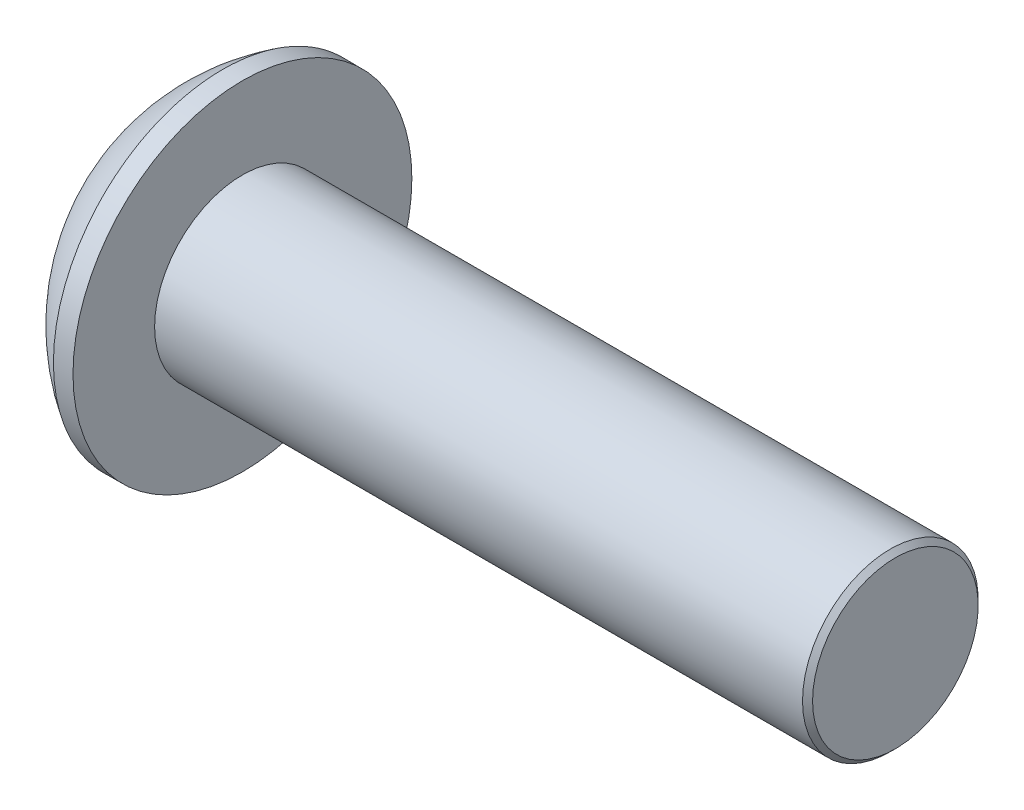
ISO-10303-21;
HEADER;
FILE_DESCRIPTION(('STEP AP214'),'2;1');
FILE_NAME('part.step','',(''),(''),'','','');
FILE_SCHEMA(('AUTOMOTIVE_DESIGN { 1 0 10303 214 1 1 1 1 }'));
ENDSEC;
DATA;
#1=APPLICATION_CONTEXT('core data for automotive mechanical design processes');
#2=APPLICATION_PROTOCOL_DEFINITION('international standard','automotive_design',2000,#1);
#3=PRODUCT_CONTEXT('',#1,'mechanical');
#4=PRODUCT('Part','Part','',(#3));
#5=PRODUCT_RELATED_PRODUCT_CATEGORY('part','',(#4));
#6=PRODUCT_DEFINITION_FORMATION('','',#4);
#7=PRODUCT_DEFINITION_CONTEXT('part definition',#1,'design');
#8=PRODUCT_DEFINITION('design','',#6,#7);
#9=PRODUCT_DEFINITION_SHAPE('','',#8);
#10=(LENGTH_UNIT() NAMED_UNIT(*) SI_UNIT(.MILLI.,.METRE.));
#11=(NAMED_UNIT(*) PLANE_ANGLE_UNIT() SI_UNIT($,.RADIAN.));
#12=(NAMED_UNIT(*) SI_UNIT($,.STERADIAN.) SOLID_ANGLE_UNIT());
#13=UNCERTAINTY_MEASURE_WITH_UNIT(LENGTH_MEASURE(1.E-05),#10,'distance_accuracy_value','');
#14=(GEOMETRIC_REPRESENTATION_CONTEXT(3) GLOBAL_UNCERTAINTY_ASSIGNED_CONTEXT((#13)) GLOBAL_UNIT_ASSIGNED_CONTEXT((#10,
#11,#12)) REPRESENTATION_CONTEXT('',''));
#15=CARTESIAN_POINT('',(0.,0.,0.));
#16=DIRECTION('',(0.,0.,1.));
#17=DIRECTION('',(1.,0.,0.));
#18=AXIS2_PLACEMENT_3D('',#15,#16,#17);
#19=CARTESIAN_POINT('',(1.32080000000034,0.,0.));
#20=DIRECTION('',(-1.,0.,0.));
#21=DIRECTION('',(0.,0.,1.));
#22=AXIS2_PLACEMENT_3D('',#19,#20,#21);
#23=CONICAL_SURFACE('',#22,1.1937999999998,1.04719755119608);
#24=CARTESIAN_POINT('',(2.01004075135902,0.,4.44089209850063E-13));
#25=VERTEX_POINT('',#24);
#26=VERTEX_LOOP('',#25);
#27=FACE_BOUND('',#26,.T.);
#28=CARTESIAN_POINT('',(1.32080000000009,0.,0.));
#29=DIRECTION('',(-1.,0.,0.));
#30=DIRECTION('',(0.,0.,1.));
#31=AXIS2_PLACEMENT_3D('',#28,#29,#30);
#32=CIRCLE('',#31,1.19380000000024);
#33=CARTESIAN_POINT('',(1.32080000000004,-1.03386112703797,0.59690000000006));
#34=VERTEX_POINT('',#33);
#35=CARTESIAN_POINT('',(1.32080000000004,0.,1.19380000000012));
#36=VERTEX_POINT('',#35);
#37=EDGE_CURVE('E18',#34,#36,#32,.T.);
#38=ORIENTED_EDGE('',*,*,#37,.T.);
#39=CARTESIAN_POINT('',(1.32080000000009,0.,0.));
#40=DIRECTION('',(-1.,0.,0.));
#41=DIRECTION('',(0.,0.,1.));
#42=AXIS2_PLACEMENT_3D('',#39,#40,#41);
#43=CIRCLE('',#42,1.19380000000024);
#44=CARTESIAN_POINT('',(1.32080000000004,1.03386112703797,0.596900000000061));
#45=VERTEX_POINT('',#44);
#46=EDGE_CURVE('E139',#36,#45,#43,.T.);
#47=ORIENTED_EDGE('',*,*,#46,.T.);
#48=CARTESIAN_POINT('',(1.32080000000009,0.,0.));
#49=DIRECTION('',(-1.,0.,0.));
#50=DIRECTION('',(0.,0.,1.));
#51=AXIS2_PLACEMENT_3D('',#48,#49,#50);
#52=CIRCLE('',#51,1.19380000000024);
#53=CARTESIAN_POINT('',(1.32080000000004,1.03386112703797,-0.596900000000061));
#54=VERTEX_POINT('',#53);
#55=EDGE_CURVE('E268',#45,#54,#52,.T.);
#56=ORIENTED_EDGE('',*,*,#55,.T.);
#57=CARTESIAN_POINT('',(1.32080000000009,0.,0.));
#58=DIRECTION('',(-1.,0.,0.));
#59=DIRECTION('',(0.,0.,1.));
#60=AXIS2_PLACEMENT_3D('',#57,#58,#59);
#61=CIRCLE('',#60,1.19380000000024);
#62=CARTESIAN_POINT('',(1.32080000000004,1.49457637585666E-12,-1.19380000000012));
#63=VERTEX_POINT('',#62);
#64=EDGE_CURVE('E266',#54,#63,#61,.T.);
#65=ORIENTED_EDGE('',*,*,#64,.T.);
#66=CARTESIAN_POINT('',(1.32080000000009,0.,0.));
#67=DIRECTION('',(-1.,0.,0.));
#68=DIRECTION('',(0.,0.,1.));
#69=AXIS2_PLACEMENT_3D('',#66,#67,#68);
#70=CIRCLE('',#69,1.19380000000024);
#71=CARTESIAN_POINT('',(1.32080000000004,-1.03386112703797,-0.59690000000006));
#72=VERTEX_POINT('',#71);
#73=EDGE_CURVE('E91',#63,#72,#70,.T.);
#74=ORIENTED_EDGE('',*,*,#73,.T.);
#75=CARTESIAN_POINT('',(1.32080000000009,0.,0.));
#76=DIRECTION('',(-1.,0.,0.));
#77=DIRECTION('',(0.,0.,1.));
#78=AXIS2_PLACEMENT_3D('',#75,#76,#77);
#79=CIRCLE('',#78,1.19380000000024);
#80=EDGE_CURVE('E87',#72,#34,#79,.T.);
#81=ORIENTED_EDGE('',*,*,#80,.T.);
#82=EDGE_LOOP('',(#38,#47,#56,#65,#74,#81));
#83=FACE_BOUND('',#82,.T.);
#84=ADVANCED_FACE('F14',(#27,#83),#23,.F.);
#85=CARTESIAN_POINT('',(1.3208,-2.06772225407572,-1.1938));
#86=DIRECTION('',(1.,0.,0.));
#87=DIRECTION('',(0.,0.,-1.));
#88=AXIS2_PLACEMENT_3D('',#85,#86,#87);
#89=PLANE('',#88);
#90=DIRECTION('',(0.,0.5,0.866025403784439));
#91=VECTOR('',#90,1.);
#92=CARTESIAN_POINT('',(1.3208,-1.37848150271715,0.));
#93=LINE('',#92,#91);
#94=CARTESIAN_POINT('',(1.3208,-0.689240751358574,1.1938));
#95=VERTEX_POINT('',#94);
#96=EDGE_CURVE('E99',#95,#34,#93,.F.);
#97=ORIENTED_EDGE('',*,*,#96,.F.);
#98=DIRECTION('',(0.,1.,0.));
#99=VECTOR('',#98,1.);
#100=CARTESIAN_POINT('',(1.3208,-0.689240751358574,1.1938));
#101=LINE('',#100,#99);
#102=EDGE_CURVE('E101',#36,#95,#101,.F.);
#103=ORIENTED_EDGE('',*,*,#102,.F.);
#104=ORIENTED_EDGE('',*,*,#37,.F.);
#105=EDGE_LOOP('',(#97,#103,#104));
#106=FACE_BOUND('',#105,.T.);
#107=ADVANCED_FACE('F97',(#106),#89,.F.);
#108=CARTESIAN_POINT('',(1.3208,-2.06772225407572,-1.1938));
#109=DIRECTION('',(1.,0.,0.));
#110=DIRECTION('',(0.,0.,-1.));
#111=AXIS2_PLACEMENT_3D('',#108,#109,#110);
#112=PLANE('',#111);
#113=DIRECTION('',(0.,-0.5,0.866025403784439));
#114=VECTOR('',#113,1.);
#115=CARTESIAN_POINT('',(1.3208,-0.689240751358574,-1.1938));
#116=LINE('',#115,#114);
#117=CARTESIAN_POINT('',(1.3208,-1.37848150271715,0.));
#118=VERTEX_POINT('',#117);
#119=EDGE_CURVE('E107',#118,#72,#116,.F.);
#120=ORIENTED_EDGE('',*,*,#119,.F.);
#121=DIRECTION('',(0.,0.5,0.866025403784439));
#122=VECTOR('',#121,1.);
#123=CARTESIAN_POINT('',(1.3208,-1.37848150271715,0.));
#124=LINE('',#123,#122);
#125=EDGE_CURVE('E104',#34,#118,#124,.F.);
#126=ORIENTED_EDGE('',*,*,#125,.F.);
#127=ORIENTED_EDGE('',*,*,#80,.F.);
#128=EDGE_LOOP('',(#120,#126,#127));
#129=FACE_BOUND('',#128,.T.);
#130=ADVANCED_FACE('F105',(#129),#112,.F.);
#131=CARTESIAN_POINT('',(1.3208,-2.06772225407572,-1.1938));
#132=DIRECTION('',(1.,0.,0.));
#133=DIRECTION('',(0.,0.,-1.));
#134=AXIS2_PLACEMENT_3D('',#131,#132,#133);
#135=PLANE('',#134);
#136=DIRECTION('',(0.,1.,0.));
#137=VECTOR('',#136,1.);
#138=CARTESIAN_POINT('',(1.3208,0.689240751358577,-1.1938));
#139=LINE('',#138,#137);
#140=CARTESIAN_POINT('',(1.3208,-0.689240751358574,-1.1938));
#141=VERTEX_POINT('',#140);
#142=EDGE_CURVE('E235',#141,#63,#139,.T.);
#143=ORIENTED_EDGE('',*,*,#142,.F.);
#144=DIRECTION('',(0.,-0.5,0.866025403784439));
#145=VECTOR('',#144,1.);
#146=CARTESIAN_POINT('',(1.3208,-0.689240751358574,-1.1938));
#147=LINE('',#146,#145);
#148=EDGE_CURVE('E240',#72,#141,#147,.F.);
#149=ORIENTED_EDGE('',*,*,#148,.F.);
#150=ORIENTED_EDGE('',*,*,#73,.F.);
#151=EDGE_LOOP('',(#143,#149,#150));
#152=FACE_BOUND('',#151,.T.);
#153=ADVANCED_FACE('F182',(#152),#135,.F.);
#154=CARTESIAN_POINT('',(1.3208,-2.06772225407572,-1.1938));
#155=DIRECTION('',(1.,0.,0.));
#156=DIRECTION('',(0.,0.,-1.));
#157=AXIS2_PLACEMENT_3D('',#154,#155,#156);
#158=PLANE('',#157);
#159=DIRECTION('',(0.,-0.5,-0.866025403784439));
#160=VECTOR('',#159,1.);
#161=CARTESIAN_POINT('',(1.3208,1.37848150271715,0.));
#162=LINE('',#161,#160);
#163=CARTESIAN_POINT('',(1.3208,0.689240751358577,-1.1938));
#164=VERTEX_POINT('',#163);
#165=EDGE_CURVE('E226',#164,#54,#162,.F.);
#166=ORIENTED_EDGE('',*,*,#165,.F.);
#167=DIRECTION('',(0.,1.,0.));
#168=VECTOR('',#167,1.);
#169=CARTESIAN_POINT('',(1.3208,0.689240751358577,-1.1938));
#170=LINE('',#169,#168);
#171=EDGE_CURVE('E232',#63,#164,#170,.T.);
#172=ORIENTED_EDGE('',*,*,#171,.F.);
#173=ORIENTED_EDGE('',*,*,#64,.F.);
#174=EDGE_LOOP('',(#166,#172,#173));
#175=FACE_BOUND('',#174,.T.);
#176=ADVANCED_FACE('F178',(#175),#158,.F.);
#177=CARTESIAN_POINT('',(1.3208,-2.06772225407572,-1.1938));
#178=DIRECTION('',(1.,0.,0.));
#179=DIRECTION('',(0.,0.,-1.));
#180=AXIS2_PLACEMENT_3D('',#177,#178,#179);
#181=PLANE('',#180);
#182=DIRECTION('',(0.,0.5,-0.866025403784439));
#183=VECTOR('',#182,1.);
#184=CARTESIAN_POINT('',(1.3208,0.689240751358576,1.1938));
#185=LINE('',#184,#183);
#186=CARTESIAN_POINT('',(1.3208,1.37848150271715,0.));
#187=VERTEX_POINT('',#186);
#188=EDGE_CURVE('E213',#187,#45,#185,.F.);
#189=ORIENTED_EDGE('',*,*,#188,.F.);
#190=DIRECTION('',(0.,-0.5,-0.866025403784439));
#191=VECTOR('',#190,1.);
#192=CARTESIAN_POINT('',(1.3208,1.37848150271715,0.));
#193=LINE('',#192,#191);
#194=EDGE_CURVE('E224',#54,#187,#193,.F.);
#195=ORIENTED_EDGE('',*,*,#194,.F.);
#196=ORIENTED_EDGE('',*,*,#55,.F.);
#197=EDGE_LOOP('',(#189,#195,#196));
#198=FACE_BOUND('',#197,.T.);
#199=ADVANCED_FACE('F174',(#198),#181,.F.);
#200=CARTESIAN_POINT('',(1.3208,-2.06772225407572,-1.1938));
#201=DIRECTION('',(1.,0.,0.));
#202=DIRECTION('',(0.,0.,-1.));
#203=AXIS2_PLACEMENT_3D('',#200,#201,#202);
#204=PLANE('',#203);
#205=DIRECTION('',(0.,1.,0.));
#206=VECTOR('',#205,1.);
#207=CARTESIAN_POINT('',(1.3208,-0.689240751358574,1.1938));
#208=LINE('',#207,#206);
#209=CARTESIAN_POINT('',(1.3208,0.689240751358576,1.1938));
#210=VERTEX_POINT('',#209);
#211=EDGE_CURVE('E116',#210,#36,#208,.F.);
#212=ORIENTED_EDGE('',*,*,#211,.F.);
#213=DIRECTION('',(0.,0.5,-0.866025403784439));
#214=VECTOR('',#213,1.);
#215=CARTESIAN_POINT('',(1.3208,0.689240751358576,1.1938));
#216=LINE('',#215,#214);
#217=EDGE_CURVE('E216',#45,#210,#216,.F.);
#218=ORIENTED_EDGE('',*,*,#217,.F.);
#219=ORIENTED_EDGE('',*,*,#46,.F.);
#220=EDGE_LOOP('',(#212,#218,#219));
#221=FACE_BOUND('',#220,.T.);
#222=ADVANCED_FACE('F170',(#221),#204,.F.);
#223=CARTESIAN_POINT('',(1.3208,-0.689240751358574,1.1938));
#224=DIRECTION('',(0.,0.,-1.));
#225=DIRECTION('',(0.,1.,0.));
#226=AXIS2_PLACEMENT_3D('',#223,#224,#225);
#227=PLANE('',#226);
#228=DIRECTION('',(0.,1.,0.));
#229=VECTOR('',#228,1.);
#230=CARTESIAN_POINT('',(0.,0.,1.1938));
#231=LINE('',#230,#229);
#232=CARTESIAN_POINT('',(0.,0.689240751358577,1.1938));
#233=VERTEX_POINT('',#232);
#234=CARTESIAN_POINT('',(0.,-0.689240751358574,1.1938));
#235=VERTEX_POINT('',#234);
#236=EDGE_CURVE('E228',#233,#235,#231,.F.);
#237=ORIENTED_EDGE('',*,*,#236,.F.);
#238=DIRECTION('',(1.,0.,0.));
#239=VECTOR('',#238,1.);
#240=CARTESIAN_POINT('',(1.3208,0.689240751358576,1.1938));
#241=LINE('',#240,#239);
#242=EDGE_CURVE('E220',#210,#233,#241,.F.);
#243=ORIENTED_EDGE('',*,*,#242,.F.);
#244=ORIENTED_EDGE('',*,*,#211,.T.);
#245=ORIENTED_EDGE('',*,*,#102,.T.);
#246=DIRECTION('',(1.,0.,0.));
#247=VECTOR('',#246,1.);
#248=CARTESIAN_POINT('',(1.3208,-0.689240751358574,1.1938));
#249=LINE('',#248,#247);
#250=EDGE_CURVE('E110',#235,#95,#249,.T.);
#251=ORIENTED_EDGE('',*,*,#250,.F.);
#252=EDGE_LOOP('',(#237,#243,#244,#245,#251));
#253=FACE_BOUND('',#252,.T.);
#254=ADVANCED_FACE('F167',(#253),#227,.T.);
#255=CARTESIAN_POINT('',(1.3208,-1.37848150271715,0.));
#256=DIRECTION('',(0.,0.866025403784439,-0.5));
#257=DIRECTION('',(0.,0.5,0.866025403784439));
#258=AXIS2_PLACEMENT_3D('',#255,#256,#257);
#259=PLANE('',#258);
#260=DIRECTION('',(0.,-0.5,-0.866025403784439));
#261=VECTOR('',#260,1.);
#262=CARTESIAN_POINT('',(0.,-0.689240751358574,1.1938));
#263=LINE('',#262,#261);
#264=CARTESIAN_POINT('',(0.,-1.37848150271715,0.));
#265=VERTEX_POINT('',#264);
#266=EDGE_CURVE('E249',#235,#265,#263,.T.);
#267=ORIENTED_EDGE('',*,*,#266,.F.);
#268=ORIENTED_EDGE('',*,*,#250,.T.);
#269=ORIENTED_EDGE('',*,*,#96,.T.);
#270=ORIENTED_EDGE('',*,*,#125,.T.);
#271=DIRECTION('',(1.,0.,0.));
#272=VECTOR('',#271,1.);
#273=CARTESIAN_POINT('',(1.3208,-1.37848150271715,0.));
#274=LINE('',#273,#272);
#275=EDGE_CURVE('E119',#265,#118,#274,.T.);
#276=ORIENTED_EDGE('',*,*,#275,.F.);
#277=EDGE_LOOP('',(#267,#268,#269,#270,#276));
#278=FACE_BOUND('',#277,.T.);
#279=ADVANCED_FACE('F114',(#278),#259,.T.);
#280=CARTESIAN_POINT('',(1.3208,-0.689240751358574,-1.1938));
#281=DIRECTION('',(0.,0.866025403784439,0.5));
#282=DIRECTION('',(0.,-0.5,0.866025403784439));
#283=AXIS2_PLACEMENT_3D('',#280,#281,#282);
#284=PLANE('',#283);
#285=DIRECTION('',(0.,0.5,-0.866025403784439));
#286=VECTOR('',#285,1.);
#287=CARTESIAN_POINT('',(0.,-1.37848150271715,0.));
#288=LINE('',#287,#286);
#289=CARTESIAN_POINT('',(0.,-0.689240751358574,-1.1938));
#290=VERTEX_POINT('',#289);
#291=EDGE_CURVE('E247',#265,#290,#288,.T.);
#292=ORIENTED_EDGE('',*,*,#291,.F.);
#293=ORIENTED_EDGE('',*,*,#275,.T.);
#294=ORIENTED_EDGE('',*,*,#119,.T.);
#295=ORIENTED_EDGE('',*,*,#148,.T.);
#296=DIRECTION('',(1.,0.,0.));
#297=VECTOR('',#296,1.);
#298=CARTESIAN_POINT('',(1.3208,-0.689240751358574,-1.1938));
#299=LINE('',#298,#297);
#300=EDGE_CURVE('E231',#290,#141,#299,.T.);
#301=ORIENTED_EDGE('',*,*,#300,.F.);
#302=EDGE_LOOP('',(#292,#293,#294,#295,#301));
#303=FACE_BOUND('',#302,.T.);
#304=ADVANCED_FACE('F160',(#303),#284,.T.);
#305=CARTESIAN_POINT('',(1.3208,0.689240751358577,-1.1938));
#306=DIRECTION('',(0.,0.,1.));
#307=DIRECTION('',(1.,0.,0.));
#308=AXIS2_PLACEMENT_3D('',#305,#306,#307);
#309=PLANE('',#308);
#310=DIRECTION('',(0.,1.,0.));
#311=VECTOR('',#310,1.);
#312=CARTESIAN_POINT('',(0.,0.,-1.1938));
#313=LINE('',#312,#311);
#314=CARTESIAN_POINT('',(0.,0.689240751358577,-1.1938));
#315=VERTEX_POINT('',#314);
#316=EDGE_CURVE('E258',#290,#315,#313,.T.);
#317=ORIENTED_EDGE('',*,*,#316,.F.);
#318=ORIENTED_EDGE('',*,*,#300,.T.);
#319=ORIENTED_EDGE('',*,*,#142,.T.);
#320=ORIENTED_EDGE('',*,*,#171,.T.);
#321=DIRECTION('',(1.,0.,0.));
#322=VECTOR('',#321,1.);
#323=CARTESIAN_POINT('',(1.3208,0.689240751358577,-1.1938));
#324=LINE('',#323,#322);
#325=EDGE_CURVE('E217',#315,#164,#324,.T.);
#326=ORIENTED_EDGE('',*,*,#325,.F.);
#327=EDGE_LOOP('',(#317,#318,#319,#320,#326));
#328=FACE_BOUND('',#327,.T.);
#329=ADVANCED_FACE('F157',(#328),#309,.T.);
#330=CARTESIAN_POINT('',(1.3208,1.37848150271715,0.));
#331=DIRECTION('',(0.,-0.866025403784439,0.5));
#332=DIRECTION('',(0.,-0.5,-0.866025403784439));
#333=AXIS2_PLACEMENT_3D('',#330,#331,#332);
#334=PLANE('',#333);
#335=DIRECTION('',(0.,0.5,0.866025403784439));
#336=VECTOR('',#335,1.);
#337=CARTESIAN_POINT('',(0.,0.689240751358577,-1.1938));
#338=LINE('',#337,#336);
#339=CARTESIAN_POINT('',(0.,1.37848150271715,0.));
#340=VERTEX_POINT('',#339);
#341=EDGE_CURVE('E261',#315,#340,#338,.T.);
#342=ORIENTED_EDGE('',*,*,#341,.F.);
#343=ORIENTED_EDGE('',*,*,#325,.T.);
#344=ORIENTED_EDGE('',*,*,#165,.T.);
#345=ORIENTED_EDGE('',*,*,#194,.T.);
#346=DIRECTION('',(1.,0.,0.));
#347=VECTOR('',#346,1.);
#348=CARTESIAN_POINT('',(1.3208,1.37848150271715,0.));
#349=LINE('',#348,#347);
#350=EDGE_CURVE('E33',#340,#187,#349,.T.);
#351=ORIENTED_EDGE('',*,*,#350,.F.);
#352=EDGE_LOOP('',(#342,#343,#344,#345,#351));
#353=FACE_BOUND('',#352,.T.);
#354=ADVANCED_FACE('F153',(#353),#334,.T.);
#355=CARTESIAN_POINT('',(1.3208,0.689240751358576,1.1938));
#356=DIRECTION('',(0.,-0.866025403784439,-0.5));
#357=DIRECTION('',(0.,0.5,-0.866025403784439));
#358=AXIS2_PLACEMENT_3D('',#355,#356,#357);
#359=PLANE('',#358);
#360=DIRECTION('',(0.,-0.5,0.866025403784439));
#361=VECTOR('',#360,1.);
#362=CARTESIAN_POINT('',(0.,1.37848150271715,0.));
#363=LINE('',#362,#361);
#364=EDGE_CURVE('E138',#340,#233,#363,.T.);
#365=ORIENTED_EDGE('',*,*,#364,.F.);
#366=ORIENTED_EDGE('',*,*,#350,.T.);
#367=ORIENTED_EDGE('',*,*,#188,.T.);
#368=ORIENTED_EDGE('',*,*,#217,.T.);
#369=ORIENTED_EDGE('',*,*,#242,.T.);
#370=EDGE_LOOP('',(#365,#366,#367,#368,#369));
#371=FACE_BOUND('',#370,.T.);
#372=ADVANCED_FACE('F149',(#371),#359,.T.);
#373=CARTESIAN_POINT('',(0.,0.,0.));
#374=DIRECTION('',(-1.,0.,0.));
#375=DIRECTION('',(0.,0.,1.));
#376=AXIS2_PLACEMENT_3D('',#373,#374,#375);
#377=PLANE('',#376);
#378=ORIENTED_EDGE('',*,*,#341,.T.);
#379=ORIENTED_EDGE('',*,*,#364,.T.);
#380=ORIENTED_EDGE('',*,*,#236,.T.);
#381=ORIENTED_EDGE('',*,*,#266,.T.);
#382=ORIENTED_EDGE('',*,*,#291,.T.);
#383=ORIENTED_EDGE('',*,*,#316,.T.);
#384=EDGE_LOOP('',(#378,#379,#380,#381,#382,#383));
#385=FACE_BOUND('',#384,.T.);
#386=CARTESIAN_POINT('',(0.,1.647825,0.));
#387=CARTESIAN_POINT('',(1.63319177039159E-13,1.64781976319874,0.0924902039777528));
#388=CARTESIAN_POINT('',(1.32889950928386E-13,1.63999511633709,0.185145014326369));
#389=CARTESIAN_POINT('',(0.,1.6167119250047,0.322075808080013));
#390=CARTESIAN_POINT('',(-1.58500534362179E-13,1.60700618770234,0.36743553339636));
#391=CARTESIAN_POINT('',(1.59063283897783E-13,1.58380101865853,0.457220935695139));
#392=CARTESIAN_POINT('',(5.69241819478296E-13,1.5702985083103,0.501645823115262));
#393=CARTESIAN_POINT('',(9.37394450765428E-13,1.52428156574313,0.632817459278965));
#394=CARTESIAN_POINT('',(0.,1.48621992666366,0.717681965518641));
#395=CARTESIAN_POINT('',(0.,1.39637079695658,0.879809706624014));
#396=CARTESIAN_POINT('',(7.82154613613799E-13,1.34458278455109,0.957072652379993));
#397=CARTESIAN_POINT('',(4.86997587203687E-13,1.25777784714521,1.06558770210237));
#398=CARTESIAN_POINT('',(1.33496382005463E-13,1.22729946114794,1.10054993332365));
#399=CARTESIAN_POINT('',(-1.32934199584443E-13,1.16354004969107,1.16775237388221));
#400=CARTESIAN_POINT('',(0.,1.13026175473033,1.19999517515816));
#401=CARTESIAN_POINT('',(0.,1.02649304340867,1.29236218866442));
#402=CARTESIAN_POINT('',(0.,0.952049986714081,1.34814848277712));
#403=CARTESIAN_POINT('',(0.,0.794895196754072,1.44639825105765));
#404=CARTESIAN_POINT('',(0.,0.712183775431299,1.48886222758992));
#405=CARTESIAN_POINT('',(0.,0.540796624265733,1.55930919813143));
#406=CARTESIAN_POINT('',(0.,0.45212095813529,1.58729234680268));
#407=CARTESIAN_POINT('',(0.,0.27133233108032,1.62797191307413));
#408=CARTESIAN_POINT('',(0.,0.179219351801792,1.64066824903626));
#409=CARTESIAN_POINT('',(0.,-0.00583077027840445,1.65041748705408));
#410=CARTESIAN_POINT('',(0.,-0.0987679130800736,1.64747038910978));
#411=CARTESIAN_POINT('',(0.,-0.28283019638882,1.62601274134435));
#412=CARTESIAN_POINT('',(0.,-0.373955346570014,1.60750227463794));
#413=CARTESIAN_POINT('',(0.,-0.551796068178799,1.55545413364523));
#414=CARTESIAN_POINT('',(0.,-0.638511592498161,1.52191629885844));
#415=CARTESIAN_POINT('',(0.,-0.805120175533148,1.44072378052347));
#416=CARTESIAN_POINT('',(0.,-0.885012976819951,1.39306856461393));
#417=CARTESIAN_POINT('',(0.,-0.997912879588353,1.31211658756413));
#418=CARTESIAN_POINT('',(0.,-1.03439492468339,1.28354906167734));
#419=CARTESIAN_POINT('',(0.,-1.10486279842068,1.22341829303709));
#420=CARTESIAN_POINT('',(0.,-1.1388461840329,1.19185218578117));
#421=CARTESIAN_POINT('',(0.,-1.23657300939908,1.09305906467359));
#422=CARTESIAN_POINT('',(0.,-1.29619288399356,1.02166556658612));
#423=CARTESIAN_POINT('',(0.,-1.40258050817755,0.869876423478032));
#424=CARTESIAN_POINT('',(0.,-1.44934874627765,0.789481120793476));
#425=CARTESIAN_POINT('',(0.,-1.50889406070375,0.663870959313341));
#426=CARTESIAN_POINT('',(0.,-1.52698985473586,0.621110806760428));
#427=CARTESIAN_POINT('',(0.,-1.55950093966664,0.534260776864332));
#428=CARTESIAN_POINT('',(-1.0510766624734E-13,-1.57391920916437,0.490172008203169));
#429=CARTESIAN_POINT('',(2.10313601541921E-13,-1.61146177909579,0.356445777718597));
#430=CARTESIAN_POINT('',(1.14393266595326E-12,-1.62897899568074,0.265126085962907));
#431=CARTESIAN_POINT('',(4.34745316852023E-13,-1.64174347214908,0.144386595969389));
#432=CARTESIAN_POINT('',(1.21685678405718E-13,-1.64402207668915,0.115560405797875));
#433=CARTESIAN_POINT('',(-1.21251997536799E-13,-1.6470636594012,0.0578281757252698));
#434=CARTESIAN_POINT('',(0.,-1.64782663757318,0.028922135824178));
#435=CARTESIAN_POINT('',(1.63508926115257E-13,-1.64781976319874,-0.0924902039777537));
#436=CARTESIAN_POINT('',(1.32795238224012E-13,-1.63999511633709,-0.18514501432637));
#437=CARTESIAN_POINT('',(0.,-1.6167119250047,-0.322075808080014));
#438=CARTESIAN_POINT('',(-1.58310280081741E-13,-1.60700618770234,-0.367435533396361));
#439=CARTESIAN_POINT('',(1.58872874902927E-13,-1.58380101865853,-0.45722093569514));
#440=CARTESIAN_POINT('',(5.68527431903721E-13,-1.5702985083103,-0.501645823115263));
#441=CARTESIAN_POINT('',(9.36221869910377E-13,-1.52428156574313,-0.632817459278966));
#442=CARTESIAN_POINT('',(0.,-1.48621992666366,-0.717681965518643));
#443=CARTESIAN_POINT('',(0.,-1.39637079695658,-0.879809706624015));
#444=CARTESIAN_POINT('',(7.80985335845033E-13,-1.34458278455109,-0.957072652379992));
#445=CARTESIAN_POINT('',(4.86281381292483E-13,-1.25777784714521,-1.06558770210237));
#446=CARTESIAN_POINT('',(1.3330030747661E-13,-1.22729946114794,-1.10054993332365));
#447=CARTESIAN_POINT('',(-1.32738314100968E-13,-1.16354004969107,-1.16775237388221));
#448=CARTESIAN_POINT('',(0.,-1.13026175473033,-1.19999517515816));
#449=CARTESIAN_POINT('',(0.,-1.02649304340867,-1.29236218866442));
#450=CARTESIAN_POINT('',(0.,-0.952049986714081,-1.34814848277713));
#451=CARTESIAN_POINT('',(0.,-0.794895196754072,-1.44639825105765));
#452=CARTESIAN_POINT('',(0.,-0.7121837754313,-1.48886222758991));
#453=CARTESIAN_POINT('',(0.,-0.540796624265734,-1.55930919813143));
#454=CARTESIAN_POINT('',(0.,-0.452120958135291,-1.58729234680268));
#455=CARTESIAN_POINT('',(0.,-0.271332331080322,-1.62797191307413));
#456=CARTESIAN_POINT('',(0.,-0.179219351801793,-1.64066824903626));
#457=CARTESIAN_POINT('',(0.,0.00583077027840386,-1.65041748705408));
#458=CARTESIAN_POINT('',(0.,0.098767913080073,-1.64747038910978));
#459=CARTESIAN_POINT('',(0.,0.28283019638882,-1.62601274134436));
#460=CARTESIAN_POINT('',(0.,0.373955346570014,-1.60750227463794));
#461=CARTESIAN_POINT('',(0.,0.551796068178799,-1.55545413364523));
#462=CARTESIAN_POINT('',(0.,0.638511592498161,-1.52191629885844));
#463=CARTESIAN_POINT('',(0.,0.805120175533147,-1.44072378052347));
#464=CARTESIAN_POINT('',(0.,0.885012976819949,-1.39306856461393));
#465=CARTESIAN_POINT('',(0.,0.997912879588353,-1.31211658756413));
#466=CARTESIAN_POINT('',(0.,1.03439492468339,-1.28354906167734));
#467=CARTESIAN_POINT('',(0.,1.10486279842068,-1.22341829303709));
#468=CARTESIAN_POINT('',(0.,1.1388461840329,-1.19185218578117));
#469=CARTESIAN_POINT('',(0.,1.23657300939908,-1.09305906467358));
#470=CARTESIAN_POINT('',(0.,1.29619288399356,-1.02166556658612));
#471=CARTESIAN_POINT('',(0.,1.40258050817755,-0.869876423478031));
#472=CARTESIAN_POINT('',(0.,1.44934874627765,-0.789481120793476));
#473=CARTESIAN_POINT('',(0.,1.50889406070375,-0.66387095931334));
#474=CARTESIAN_POINT('',(0.,1.52698985473586,-0.621110806760427));
#475=CARTESIAN_POINT('',(0.,1.55950093966664,-0.534260776864331));
#476=CARTESIAN_POINT('',(-1.0516333620321E-13,1.57391920916437,-0.490172008203168));
#477=CARTESIAN_POINT('',(2.10424649557123E-13,1.61146177909579,-0.356445777718596));
#478=CARTESIAN_POINT('',(1.1439193537722E-12,1.62897899568074,-0.265126085962906));
#479=CARTESIAN_POINT('',(4.34749479635671E-13,1.64174347214908,-0.144386595969388));
#480=CARTESIAN_POINT('',(1.21707466173689E-13,1.64402207668915,-0.115560405797875));
#481=CARTESIAN_POINT('',(-1.21273785304769E-13,1.6470636594012,-0.0578281757252702));
#482=CARTESIAN_POINT('',(0.,1.64782663757318,-0.0289221358241786));
#483=CARTESIAN_POINT('',(0.,1.647825,0.));
#484=B_SPLINE_CURVE_WITH_KNOTS('',3,(#386,#387,#388,#389,#390,#391,#392,#393,#394,#395,#396,
#397,#398,#399,#400,#401,#402,#403,#404,#405,#406,#407,#408,#409,#410,#411,#412,#413,#414,#415,
#416,#417,#418,#419,#420,#421,#422,#423,#424,#425,#426,#427,#428,#429,#430,#431,#432,#433,#434,
#435,#436,#437,#438,#439,#440,#441,#442,#443,#444,#445,#446,#447,#448,#449,#450,#451,#452,#453,
#454,#455,#456,#457,#458,#459,#460,#461,#462,#463,#464,#465,#466,#467,#468,#469,#470,#471,#472,
#473,#474,#475,#476,#477,#478,#479,#480,#481,#482,#483),.UNSPECIFIED.,.T.,.F.,(4,2,2,2,2,2,2,2,
2,2,2,2,2,2,2,2,2,2,2,2,2,2,2,2,2,2,2,2,2,2,2,2,2,2,2,2,2,2,2,2,2,2,2,2,2,2,2,2,4),(0.,
0.277336029422425,0.41636854153711,0.555514114625598,0.833141970294985,1.11078038089036,
1.24978149120748,1.38864858351854,1.66629367015055,1.94392828594774,2.22155993641642,
2.49919306954937,2.77682620268234,3.05445785315101,3.3320924689482,3.6097375555799,
3.74860464789074,3.88760575820767,4.16524416880332,4.44287202447287,4.5820175975616,
4.72105010967661,4.99838613909882,5.08511046196676,5.17183478483476,5.44917081425719,
5.58820332637187,5.72734889946036,6.00497675512975,6.28261516572512,6.42161627604224,
6.5604833683533,6.83812845498532,7.1157630707825,7.39339472125118,7.67102785438413,
7.9486609875171,8.22629263798577,8.50392725378296,8.78157234041466,8.9204394327255,
9.05944054304243,9.33707895363808,9.61470680930763,9.75385238239636,9.89288489451138,
10.1702209239336,10.2569452468015,10.3436695696695),.UNSPECIFIED.);
#485=CARTESIAN_POINT('',(0.,1.647825,0.));
#486=VERTEX_POINT('',#485);
#487=EDGE_CURVE('E131',#486,#486,#484,.T.);
#488=ORIENTED_EDGE('',*,*,#487,.F.);
#489=EDGE_LOOP('',(#488));
#490=FACE_BOUND('',#489,.T.);
#491=ADVANCED_FACE('F145',(#385,#490),#377,.T.);
#492=CARTESIAN_POINT('',(3.50132362607759,0.,0.));
#493=DIRECTION('',(0.,1.,0.));
#494=DIRECTION('',(1.,0.,0.));
#495=AXIS2_PLACEMENT_3D('',#492,#493,#494);
#496=SPHERICAL_SURFACE('',#495,3.86970210289553);
#497=CARTESIAN_POINT('',(1.4732,0.,0.));
#498=DIRECTION('',(-1.,0.,0.));
#499=DIRECTION('',(0.,0.,1.));
#500=AXIS2_PLACEMENT_3D('',#497,#498,#499);
#501=CIRCLE('',#500,3.29565);
#502=CARTESIAN_POINT('',(1.4732,0.,3.29565));
#503=VERTEX_POINT('',#502);
#504=EDGE_CURVE('E128',#503,#503,#501,.F.);
#505=ORIENTED_EDGE('',*,*,#504,.F.);
#506=EDGE_LOOP('',(#505));
#507=FACE_BOUND('',#506,.T.);
#508=ORIENTED_EDGE('',*,*,#487,.T.);
#509=EDGE_LOOP('',(#508));
#510=FACE_BOUND('',#509,.T.);
#511=ADVANCED_FACE('F141',(#507,#510),#496,.T.);
#512=CARTESIAN_POINT('',(14.5542,0.,0.));
#513=DIRECTION('',(-1.,0.,0.));
#514=DIRECTION('',(0.,0.,1.));
#515=AXIS2_PLACEMENT_3D('',#512,#513,#514);
#516=PLANE('',#515);
#517=CARTESIAN_POINT('',(14.5542000000205,0.,0.));
#518=DIRECTION('',(-1.,0.,0.));
#519=DIRECTION('',(0.,0.,1.));
#520=AXIS2_PLACEMENT_3D('',#517,#518,#519);
#521=CIRCLE('',#520,1.61036000002923);
#522=CARTESIAN_POINT('',(14.5542000000205,0.,1.61036000002923));
#523=VERTEX_POINT('',#522);
#524=EDGE_CURVE('E125',#523,#523,#521,.T.);
#525=ORIENTED_EDGE('',*,*,#524,.F.);
#526=EDGE_LOOP('',(#525));
#527=FACE_BOUND('',#526,.T.);
#528=ADVANCED_FACE('F276',(#527),#516,.F.);
#529=CARTESIAN_POINT('',(0.,0.,0.));
#530=DIRECTION('',(-1.,0.,0.));
#531=DIRECTION('',(0.,0.,1.));
#532=AXIS2_PLACEMENT_3D('',#529,#530,#531);
#533=CYLINDRICAL_SURFACE('',#532,3.29565);
#534=ORIENTED_EDGE('',*,*,#504,.T.);
#535=EDGE_LOOP('',(#534));
#536=FACE_BOUND('',#535,.T.);
#537=CARTESIAN_POINT('',(1.8542,0.,0.));
#538=DIRECTION('',(-1.,0.,0.));
#539=DIRECTION('',(0.,0.,1.));
#540=AXIS2_PLACEMENT_3D('',#537,#538,#539);
#541=CIRCLE('',#540,3.29565);
#542=CARTESIAN_POINT('',(1.8542,0.,3.29565));
#543=VERTEX_POINT('',#542);
#544=EDGE_CURVE('E122',#543,#543,#541,.T.);
#545=ORIENTED_EDGE('',*,*,#544,.T.);
#546=EDGE_LOOP('',(#545));
#547=FACE_BOUND('',#546,.T.);
#548=ADVANCED_FACE('F281',(#536,#547),#533,.T.);
#549=CARTESIAN_POINT('',(14.4564100001503,0.,0.));
#550=DIRECTION('',(-1.,0.,0.));
#551=DIRECTION('',(0.,0.,1.));
#552=AXIS2_PLACEMENT_3D('',#549,#550,#551);
#553=CONICAL_SURFACE('',#552,1.70814999989943,0.785398163397448);
#554=CARTESIAN_POINT('',(14.45641,0.,0.));
#555=DIRECTION('',(-1.,0.,0.));
#556=DIRECTION('',(0.,0.,1.));
#557=AXIS2_PLACEMENT_3D('',#554,#555,#556);
#558=CIRCLE('',#557,1.70815);
#559=CARTESIAN_POINT('',(14.45641,0.,1.70815));
#560=VERTEX_POINT('',#559);
#561=EDGE_CURVE('E24',#560,#560,#558,.T.);
#562=ORIENTED_EDGE('',*,*,#561,.F.);
#563=EDGE_LOOP('',(#562));
#564=FACE_BOUND('',#563,.T.);
#565=ORIENTED_EDGE('',*,*,#524,.T.);
#566=EDGE_LOOP('',(#565));
#567=FACE_BOUND('',#566,.T.);
#568=ADVANCED_FACE('F202',(#564,#567),#553,.T.);
#569=CARTESIAN_POINT('',(1.8542,1.70815,0.));
#570=DIRECTION('',(-1.,0.,0.));
#571=DIRECTION('',(0.,0.,1.));
#572=AXIS2_PLACEMENT_3D('',#569,#570,#571);
#573=PLANE('',#572);
#574=CARTESIAN_POINT('',(1.8542,0.,0.));
#575=DIRECTION('',(-1.,0.,0.));
#576=DIRECTION('',(0.,0.,1.));
#577=AXIS2_PLACEMENT_3D('',#574,#575,#576);
#578=CIRCLE('',#577,1.70815);
#579=CARTESIAN_POINT('',(1.8542,0.,1.70815));
#580=VERTEX_POINT('',#579);
#581=EDGE_CURVE('E9',#580,#580,#578,.F.);
#582=ORIENTED_EDGE('',*,*,#581,.F.);
#583=EDGE_LOOP('',(#582));
#584=FACE_BOUND('',#583,.T.);
#585=ORIENTED_EDGE('',*,*,#544,.F.);
#586=EDGE_LOOP('',(#585));
#587=FACE_BOUND('',#586,.T.);
#588=ADVANCED_FACE('F197',(#584,#587),#573,.F.);
#589=CARTESIAN_POINT('',(0.,0.,0.));
#590=DIRECTION('',(-1.,0.,0.));
#591=DIRECTION('',(0.,0.,1.));
#592=AXIS2_PLACEMENT_3D('',#589,#590,#591);
#593=CYLINDRICAL_SURFACE('',#592,1.70815);
#594=ORIENTED_EDGE('',*,*,#581,.T.);
#595=EDGE_LOOP('',(#594));
#596=FACE_BOUND('',#595,.T.);
#597=ORIENTED_EDGE('',*,*,#561,.T.);
#598=EDGE_LOOP('',(#597));
#599=FACE_BOUND('',#598,.T.);
#600=ADVANCED_FACE('F16',(#596,#599),#593,.T.);
#601=CLOSED_SHELL('',(#84,#107,#130,#153,#176,#199,#222,#254,#279,#304,#329,#354,#372,#491,#511,
#528,#548,#568,#588,#600));
#602=MANIFOLD_SOLID_BREP('B1',#601);
#603=ADVANCED_BREP_SHAPE_REPRESENTATION('',(#18,#602),#14);
#604=SHAPE_DEFINITION_REPRESENTATION(#9,#603);
ENDSEC;
END-ISO-10303-21;
